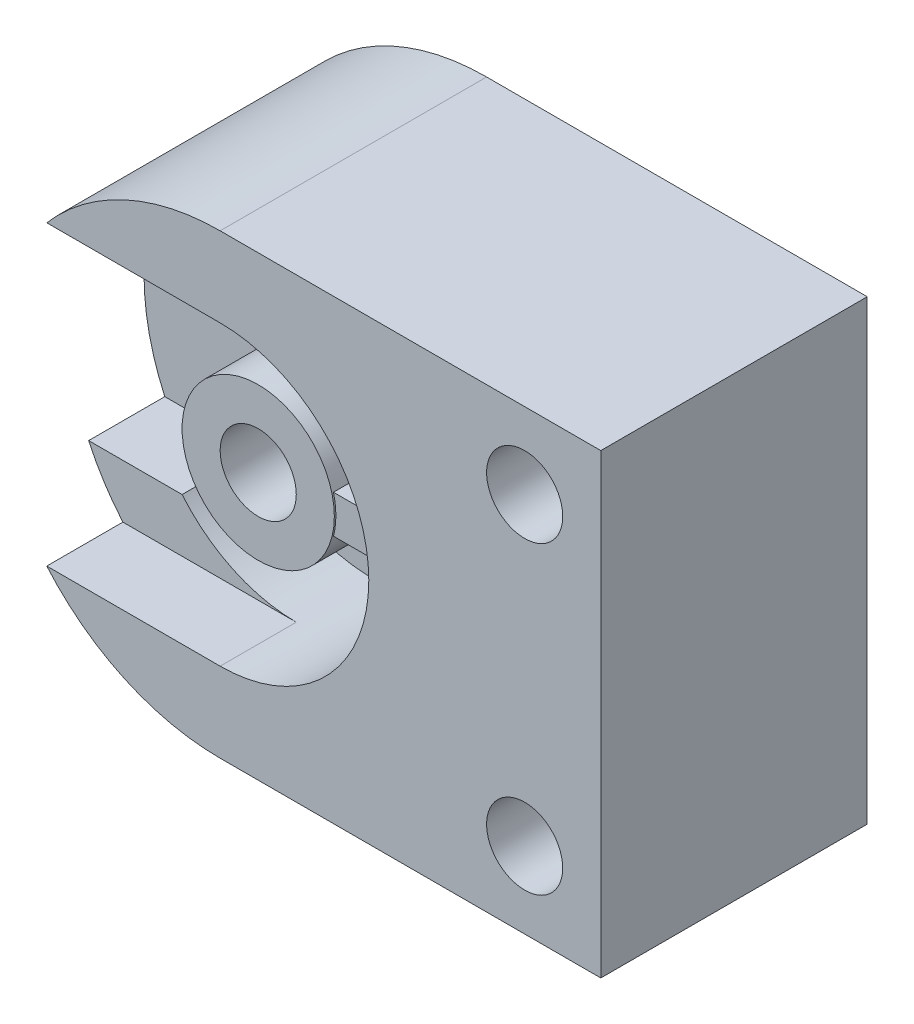
ISO-10303-21;
HEADER;
FILE_DESCRIPTION(('STEP AP214'),'2;1');
FILE_NAME('part.step','',(''),(''),'','','');
FILE_SCHEMA(('AUTOMOTIVE_DESIGN { 1 0 10303 214 1 1 1 1 }'));
ENDSEC;
DATA;
#1=APPLICATION_CONTEXT('core data for automotive mechanical design processes');
#2=APPLICATION_PROTOCOL_DEFINITION('international standard','automotive_design',2000,#1);
#3=PRODUCT_CONTEXT('',#1,'mechanical');
#4=PRODUCT('Part','Part','',(#3));
#5=PRODUCT_RELATED_PRODUCT_CATEGORY('part','',(#4));
#6=PRODUCT_DEFINITION_FORMATION('','',#4);
#7=PRODUCT_DEFINITION_CONTEXT('part definition',#1,'design');
#8=PRODUCT_DEFINITION('design','',#6,#7);
#9=PRODUCT_DEFINITION_SHAPE('','',#8);
#10=(LENGTH_UNIT() NAMED_UNIT(*) SI_UNIT(.MILLI.,.METRE.));
#11=(NAMED_UNIT(*) PLANE_ANGLE_UNIT() SI_UNIT($,.RADIAN.));
#12=(NAMED_UNIT(*) SI_UNIT($,.STERADIAN.) SOLID_ANGLE_UNIT());
#13=UNCERTAINTY_MEASURE_WITH_UNIT(LENGTH_MEASURE(1.E-05),#10,'distance_accuracy_value','');
#14=(GEOMETRIC_REPRESENTATION_CONTEXT(3) GLOBAL_UNCERTAINTY_ASSIGNED_CONTEXT((#13)) GLOBAL_UNIT_ASSIGNED_CONTEXT((#10,
#11,#12)) REPRESENTATION_CONTEXT('',''));
#15=CARTESIAN_POINT('',(0.,0.,0.));
#16=DIRECTION('',(0.,0.,1.));
#17=DIRECTION('',(1.,0.,0.));
#18=AXIS2_PLACEMENT_3D('',#15,#16,#17);
#19=CARTESIAN_POINT('',(60.,60.,0.));
#20=DIRECTION('',(0.,0.,1.));
#21=DIRECTION('',(1.,0.,0.));
#22=AXIS2_PLACEMENT_3D('',#19,#20,#21);
#23=CYLINDRICAL_SURFACE('',#22,60.);
#24=DIRECTION('',(0.,0.,-1.));
#25=VECTOR('',#24,1.);
#26=CARTESIAN_POINT('',(14.4478321042785,99.0512483795333,20.));
#27=LINE('',#26,#25);
#28=CARTESIAN_POINT('',(14.4478321042785,99.0512483795333,20.));
#29=VERTEX_POINT('',#28);
#30=CARTESIAN_POINT('',(14.4478321042785,99.0512483795333,0.));
#31=VERTEX_POINT('',#30);
#32=EDGE_CURVE('E290',#29,#31,#27,.T.);
#33=ORIENTED_EDGE('',*,*,#32,.F.);
#34=CARTESIAN_POINT('',(60.,60.,20.));
#35=DIRECTION('',(0.,0.,-1.));
#36=DIRECTION('',(-1.,0.,0.));
#37=AXIS2_PLACEMENT_3D('',#34,#35,#36);
#38=CIRCLE('',#37,60.);
#39=CARTESIAN_POINT('',(14.4478321042785,20.9487516204667,20.));
#40=VERTEX_POINT('',#39);
#41=EDGE_CURVE('E274',#40,#29,#38,.T.);
#42=ORIENTED_EDGE('',*,*,#41,.F.);
#43=DIRECTION('',(0.,0.,-1.));
#44=VECTOR('',#43,1.);
#45=CARTESIAN_POINT('',(14.4478321042785,20.9487516204667,20.));
#46=LINE('',#45,#44);
#47=CARTESIAN_POINT('',(14.4478321042785,20.9487516204667,0.));
#48=VERTEX_POINT('',#47);
#49=EDGE_CURVE('E292',#40,#48,#46,.T.);
#50=ORIENTED_EDGE('',*,*,#49,.T.);
#51=CARTESIAN_POINT('',(60.,60.,0.));
#52=DIRECTION('',(0.,0.,1.));
#53=DIRECTION('',(1.,0.,0.));
#54=AXIS2_PLACEMENT_3D('',#51,#52,#53);
#55=CIRCLE('',#54,60.);
#56=CARTESIAN_POINT('',(60.,0.,0.));
#57=VERTEX_POINT('',#56);
#58=EDGE_CURVE('E328',#48,#57,#55,.T.);
#59=ORIENTED_EDGE('',*,*,#58,.T.);
#60=DIRECTION('',(0.,0.,1.));
#61=VECTOR('',#60,1.);
#62=CARTESIAN_POINT('',(60.,0.,0.));
#63=LINE('',#62,#61);
#64=CARTESIAN_POINT('',(60.,0.,70.));
#65=VERTEX_POINT('',#64);
#66=EDGE_CURVE('E320',#57,#65,#63,.T.);
#67=ORIENTED_EDGE('',*,*,#66,.T.);
#68=CARTESIAN_POINT('',(60.,60.,70.));
#69=DIRECTION('',(0.,0.,1.));
#70=DIRECTION('',(1.,0.,0.));
#71=AXIS2_PLACEMENT_3D('',#68,#69,#70);
#72=CIRCLE('',#71,60.);
#73=CARTESIAN_POINT('',(14.4478321042785,20.9487516204667,70.));
#74=VERTEX_POINT('',#73);
#75=EDGE_CURVE('E323',#74,#65,#72,.T.);
#76=ORIENTED_EDGE('',*,*,#75,.F.);
#77=DIRECTION('',(0.,0.,1.));
#78=VECTOR('',#77,1.);
#79=CARTESIAN_POINT('',(14.4478321042785,20.9487516204667,50.));
#80=LINE('',#79,#78);
#81=CARTESIAN_POINT('',(14.4478321042785,20.9487516204667,50.));
#82=VERTEX_POINT('',#81);
#83=EDGE_CURVE('E261',#82,#74,#80,.T.);
#84=ORIENTED_EDGE('',*,*,#83,.F.);
#85=CARTESIAN_POINT('',(60.,60.,50.));
#86=DIRECTION('',(0.,0.,1.));
#87=DIRECTION('',(1.,0.,0.));
#88=AXIS2_PLACEMENT_3D('',#85,#86,#87);
#89=CIRCLE('',#88,60.);
#90=CARTESIAN_POINT('',(5.45643942682143,35.,50.));
#91=VERTEX_POINT('',#90);
#92=EDGE_CURVE('E242',#91,#82,#89,.T.);
#93=ORIENTED_EDGE('',*,*,#92,.F.);
#94=DIRECTION('',(0.,0.,1.));
#95=VECTOR('',#94,1.);
#96=CARTESIAN_POINT('',(5.45643942682143,35.,30.));
#97=LINE('',#96,#95);
#98=CARTESIAN_POINT('',(5.45643942682143,35.,30.));
#99=VERTEX_POINT('',#98);
#100=EDGE_CURVE('E233',#99,#91,#97,.T.);
#101=ORIENTED_EDGE('',*,*,#100,.F.);
#102=CARTESIAN_POINT('',(60.,60.,30.));
#103=DIRECTION('',(0.,0.,1.));
#104=DIRECTION('',(1.,0.,0.));
#105=AXIS2_PLACEMENT_3D('',#102,#103,#104);
#106=CIRCLE('',#105,60.);
#107=CARTESIAN_POINT('',(5.45643942682143,85.,30.));
#108=VERTEX_POINT('',#107);
#109=EDGE_CURVE('E216',#108,#99,#106,.T.);
#110=ORIENTED_EDGE('',*,*,#109,.F.);
#111=DIRECTION('',(0.,0.,1.));
#112=VECTOR('',#111,1.);
#113=CARTESIAN_POINT('',(5.45643942682143,85.,30.));
#114=LINE('',#113,#112);
#115=CARTESIAN_POINT('',(5.45643942682143,85.,50.));
#116=VERTEX_POINT('',#115);
#117=EDGE_CURVE('E235',#108,#116,#114,.T.);
#118=ORIENTED_EDGE('',*,*,#117,.T.);
#119=CARTESIAN_POINT('',(14.4478321042785,99.0512483795333,50.));
#120=VERTEX_POINT('',#119);
#121=EDGE_CURVE('E244',#120,#116,#89,.T.);
#122=ORIENTED_EDGE('',*,*,#121,.F.);
#123=DIRECTION('',(0.,0.,1.));
#124=VECTOR('',#123,1.);
#125=CARTESIAN_POINT('',(14.4478321042785,99.0512483795333,50.));
#126=LINE('',#125,#124);
#127=CARTESIAN_POINT('',(14.4478321042785,99.0512483795333,70.));
#128=VERTEX_POINT('',#127);
#129=EDGE_CURVE('E263',#120,#128,#126,.T.);
#130=ORIENTED_EDGE('',*,*,#129,.T.);
#131=CARTESIAN_POINT('',(60.,120.,70.));
#132=VERTEX_POINT('',#131);
#133=EDGE_CURVE('E329',#132,#128,#72,.T.);
#134=ORIENTED_EDGE('',*,*,#133,.F.);
#135=DIRECTION('',(0.,0.,1.));
#136=VECTOR('',#135,1.);
#137=CARTESIAN_POINT('',(60.,120.,0.));
#138=LINE('',#137,#136);
#139=CARTESIAN_POINT('',(60.,120.,0.));
#140=VERTEX_POINT('',#139);
#141=EDGE_CURVE('E327',#140,#132,#138,.T.);
#142=ORIENTED_EDGE('',*,*,#141,.F.);
#143=EDGE_CURVE('E324',#140,#31,#55,.T.);
#144=ORIENTED_EDGE('',*,*,#143,.T.);
#145=EDGE_LOOP('',(#33,#42,#50,#59,#67,#76,#84,#93,#101,#110,#118,#122,#130,#134,#142,#144));
#146=FACE_BOUND('',#145,.T.);
#147=ADVANCED_FACE('F33',(#146),#23,.T.);
#148=CARTESIAN_POINT('',(0.,0.,50.));
#149=DIRECTION('',(0.,0.,1.));
#150=DIRECTION('',(1.,0.,0.));
#151=AXIS2_PLACEMENT_3D('',#148,#149,#150);
#152=PLANE('',#151);
#153=DIRECTION('',(-1.,0.,0.));
#154=VECTOR('',#153,1.);
#155=CARTESIAN_POINT('',(0.,20.9487516204667,50.));
#156=LINE('',#155,#154);
#157=CARTESIAN_POINT('',(59.9999999999999,20.9487516204667,50.));
#158=VERTEX_POINT('',#157);
#159=EDGE_CURVE('E247',#158,#82,#156,.T.);
#160=ORIENTED_EDGE('',*,*,#159,.F.);
#161=CARTESIAN_POINT('',(60.,60.,50.));
#162=DIRECTION('',(0.,0.,1.));
#163=DIRECTION('',(1.,0.,0.));
#164=AXIS2_PLACEMENT_3D('',#161,#162,#163);
#165=CIRCLE('',#164,39.0512483795333);
#166=CARTESIAN_POINT('',(30.,35.,50.));
#167=VERTEX_POINT('',#166);
#168=EDGE_CURVE('E354',#158,#167,#165,.F.);
#169=ORIENTED_EDGE('',*,*,#168,.T.);
#170=DIRECTION('',(-1.,0.,0.));
#171=VECTOR('',#170,1.);
#172=CARTESIAN_POINT('',(0.,35.,50.));
#173=LINE('',#172,#171);
#174=EDGE_CURVE('E226',#167,#91,#173,.T.);
#175=ORIENTED_EDGE('',*,*,#174,.T.);
#176=ORIENTED_EDGE('',*,*,#92,.T.);
#177=EDGE_LOOP('',(#160,#169,#175,#176));
#178=FACE_BOUND('',#177,.T.);
#179=ADVANCED_FACE('F429',(#178),#152,.T.);
#180=DIRECTION('',(-1.,0.,0.));
#181=VECTOR('',#180,1.);
#182=CARTESIAN_POINT('',(0.,85.,50.));
#183=LINE('',#182,#181);
#184=CARTESIAN_POINT('',(30.,85.,50.));
#185=VERTEX_POINT('',#184);
#186=EDGE_CURVE('E224',#185,#116,#183,.T.);
#187=ORIENTED_EDGE('',*,*,#186,.F.);
#188=CARTESIAN_POINT('',(60.,60.,50.));
#189=DIRECTION('',(0.,0.,1.));
#190=DIRECTION('',(1.,0.,0.));
#191=AXIS2_PLACEMENT_3D('',#188,#189,#190);
#192=CIRCLE('',#191,39.0512483795333);
#193=CARTESIAN_POINT('',(60.0000000000004,99.0512483795333,50.));
#194=VERTEX_POINT('',#193);
#195=EDGE_CURVE('E56',#185,#194,#192,.F.);
#196=ORIENTED_EDGE('',*,*,#195,.T.);
#197=DIRECTION('',(-1.,0.,0.));
#198=VECTOR('',#197,1.);
#199=CARTESIAN_POINT('',(0.,99.0512483795333,50.));
#200=LINE('',#199,#198);
#201=EDGE_CURVE('E239',#194,#120,#200,.T.);
#202=ORIENTED_EDGE('',*,*,#201,.T.);
#203=ORIENTED_EDGE('',*,*,#121,.T.);
#204=EDGE_LOOP('',(#187,#196,#202,#203));
#205=FACE_BOUND('',#204,.T.);
#206=ADVANCED_FACE('F380',(#205),#152,.T.);
#207=CARTESIAN_POINT('',(0.,0.,70.));
#208=DIRECTION('',(0.,0.,-1.));
#209=DIRECTION('',(-1.,0.,0.));
#210=AXIS2_PLACEMENT_3D('',#207,#208,#209);
#211=PLANE('',#210);
#212=CARTESIAN_POINT('',(140.,20.,70.));
#213=DIRECTION('',(0.,0.,1.));
#214=DIRECTION('',(1.,0.,0.));
#215=AXIS2_PLACEMENT_3D('',#212,#213,#214);
#216=CIRCLE('',#215,10.);
#217=CARTESIAN_POINT('',(150.,20.,70.));
#218=VERTEX_POINT('',#217);
#219=EDGE_CURVE('E308',#218,#218,#216,.T.);
#220=ORIENTED_EDGE('',*,*,#219,.F.);
#221=EDGE_LOOP('',(#220));
#222=FACE_BOUND('',#221,.T.);
#223=CARTESIAN_POINT('',(140.,100.,70.));
#224=DIRECTION('',(0.,0.,1.));
#225=DIRECTION('',(1.,0.,0.));
#226=AXIS2_PLACEMENT_3D('',#223,#224,#225);
#227=CIRCLE('',#226,10.);
#228=CARTESIAN_POINT('',(150.,100.,70.));
#229=VERTEX_POINT('',#228);
#230=EDGE_CURVE('E289',#229,#229,#227,.T.);
#231=ORIENTED_EDGE('',*,*,#230,.F.);
#232=EDGE_LOOP('',(#231));
#233=FACE_BOUND('',#232,.T.);
#234=DIRECTION('',(-1.,0.,0.));
#235=VECTOR('',#234,1.);
#236=CARTESIAN_POINT('',(0.,20.9487516204667,70.));
#237=LINE('',#236,#235);
#238=CARTESIAN_POINT('',(59.9999999999999,20.9487516204667,70.));
#239=VERTEX_POINT('',#238);
#240=EDGE_CURVE('E243',#239,#74,#237,.T.);
#241=ORIENTED_EDGE('',*,*,#240,.T.);
#242=ORIENTED_EDGE('',*,*,#75,.T.);
#243=DIRECTION('',(1.,0.,0.));
#244=VECTOR('',#243,1.);
#245=CARTESIAN_POINT('',(0.,0.,70.));
#246=LINE('',#245,#244);
#247=CARTESIAN_POINT('',(160.,0.,70.));
#248=VERTEX_POINT('',#247);
#249=EDGE_CURVE('E335',#65,#248,#246,.T.);
#250=ORIENTED_EDGE('',*,*,#249,.T.);
#251=DIRECTION('',(0.,1.,0.));
#252=VECTOR('',#251,1.);
#253=CARTESIAN_POINT('',(160.,0.,70.));
#254=LINE('',#253,#252);
#255=CARTESIAN_POINT('',(160.,120.,70.));
#256=VERTEX_POINT('',#255);
#257=EDGE_CURVE('E337',#248,#256,#254,.T.);
#258=ORIENTED_EDGE('',*,*,#257,.T.);
#259=DIRECTION('',(-1.,0.,0.));
#260=VECTOR('',#259,1.);
#261=CARTESIAN_POINT('',(0.,120.,70.));
#262=LINE('',#261,#260);
#263=EDGE_CURVE('E340',#256,#132,#262,.T.);
#264=ORIENTED_EDGE('',*,*,#263,.T.);
#265=ORIENTED_EDGE('',*,*,#133,.T.);
#266=DIRECTION('',(-1.,0.,0.));
#267=VECTOR('',#266,1.);
#268=CARTESIAN_POINT('',(0.,99.0512483795333,70.));
#269=LINE('',#268,#267);
#270=CARTESIAN_POINT('',(60.0000000000004,99.0512483795333,70.));
#271=VERTEX_POINT('',#270);
#272=EDGE_CURVE('E253',#271,#128,#269,.T.);
#273=ORIENTED_EDGE('',*,*,#272,.F.);
#274=CARTESIAN_POINT('',(60.,60.,70.));
#275=DIRECTION('',(0.,0.,1.));
#276=DIRECTION('',(1.,0.,0.));
#277=AXIS2_PLACEMENT_3D('',#274,#275,#276);
#278=CIRCLE('',#277,39.0512483795333);
#279=EDGE_CURVE('E232',#271,#239,#278,.F.);
#280=ORIENTED_EDGE('',*,*,#279,.T.);
#281=EDGE_LOOP('',(#241,#242,#250,#258,#264,#265,#273,#280));
#282=FACE_BOUND('',#281,.T.);
#283=ADVANCED_FACE('F386',(#222,#233,#282),#211,.F.);
#284=CARTESIAN_POINT('',(60.,60.,70.));
#285=DIRECTION('',(0.,0.,-1.));
#286=DIRECTION('',(-1.,0.,0.));
#287=AXIS2_PLACEMENT_3D('',#284,#285,#286);
#288=CYLINDRICAL_SURFACE('',#287,9.99999999999999);
#289=CARTESIAN_POINT('',(60.,60.,20.));
#290=DIRECTION('',(0.,0.,-1.));
#291=DIRECTION('',(-1.,0.,0.));
#292=AXIS2_PLACEMENT_3D('',#289,#290,#291);
#293=CIRCLE('',#292,9.99999999999999);
#294=CARTESIAN_POINT('',(50.,60.,20.));
#295=VERTEX_POINT('',#294);
#296=EDGE_CURVE('E260',#295,#295,#293,.T.);
#297=ORIENTED_EDGE('',*,*,#296,.T.);
#298=EDGE_LOOP('',(#297));
#299=FACE_BOUND('',#298,.T.);
#300=CARTESIAN_POINT('',(60.,60.,60.));
#301=DIRECTION('',(0.,0.,1.));
#302=DIRECTION('',(1.,0.,0.));
#303=AXIS2_PLACEMENT_3D('',#300,#301,#302);
#304=CIRCLE('',#303,9.99999999999999);
#305=CARTESIAN_POINT('',(70.,60.,60.));
#306=VERTEX_POINT('',#305);
#307=EDGE_CURVE('E203',#306,#306,#304,.T.);
#308=ORIENTED_EDGE('',*,*,#307,.T.);
#309=EDGE_LOOP('',(#308));
#310=FACE_BOUND('',#309,.T.);
#311=ADVANCED_FACE('F442',(#299,#310),#288,.F.);
#312=CARTESIAN_POINT('',(0.,0.,0.));
#313=DIRECTION('',(0.,0.,-1.));
#314=DIRECTION('',(-1.,0.,0.));
#315=AXIS2_PLACEMENT_3D('',#312,#313,#314);
#316=PLANE('',#315);
#317=DIRECTION('',(-1.,0.,0.));
#318=VECTOR('',#317,1.);
#319=CARTESIAN_POINT('',(0.,120.,0.));
#320=LINE('',#319,#318);
#321=CARTESIAN_POINT('',(160.,120.,0.));
#322=VERTEX_POINT('',#321);
#323=EDGE_CURVE('E338',#322,#140,#320,.T.);
#324=ORIENTED_EDGE('',*,*,#323,.F.);
#325=DIRECTION('',(0.,1.,0.));
#326=VECTOR('',#325,1.);
#327=CARTESIAN_POINT('',(160.,0.,0.));
#328=LINE('',#327,#326);
#329=CARTESIAN_POINT('',(160.,0.,0.));
#330=VERTEX_POINT('',#329);
#331=EDGE_CURVE('E345',#330,#322,#328,.T.);
#332=ORIENTED_EDGE('',*,*,#331,.F.);
#333=DIRECTION('',(1.,0.,0.));
#334=VECTOR('',#333,1.);
#335=CARTESIAN_POINT('',(0.,0.,0.));
#336=LINE('',#335,#334);
#337=EDGE_CURVE('E334',#57,#330,#336,.T.);
#338=ORIENTED_EDGE('',*,*,#337,.F.);
#339=ORIENTED_EDGE('',*,*,#58,.F.);
#340=DIRECTION('',(-1.,0.,0.));
#341=VECTOR('',#340,1.);
#342=CARTESIAN_POINT('',(0.,20.9487516204667,0.));
#343=LINE('',#342,#341);
#344=CARTESIAN_POINT('',(60.0000000000001,20.9487516204667,0.));
#345=VERTEX_POINT('',#344);
#346=EDGE_CURVE('E282',#345,#48,#343,.T.);
#347=ORIENTED_EDGE('',*,*,#346,.F.);
#348=CARTESIAN_POINT('',(60.,60.,0.));
#349=DIRECTION('',(0.,0.,-1.));
#350=DIRECTION('',(-1.,0.,0.));
#351=AXIS2_PLACEMENT_3D('',#348,#349,#350);
#352=CIRCLE('',#351,39.0512483795333);
#353=CARTESIAN_POINT('',(59.9999999999996,99.0512483795333,0.));
#354=VERTEX_POINT('',#353);
#355=EDGE_CURVE('E280',#345,#354,#352,.F.);
#356=ORIENTED_EDGE('',*,*,#355,.T.);
#357=DIRECTION('',(-1.,0.,0.));
#358=VECTOR('',#357,1.);
#359=CARTESIAN_POINT('',(0.,99.0512483795333,0.));
#360=LINE('',#359,#358);
#361=EDGE_CURVE('E271',#354,#31,#360,.T.);
#362=ORIENTED_EDGE('',*,*,#361,.T.);
#363=ORIENTED_EDGE('',*,*,#143,.F.);
#364=EDGE_LOOP('',(#324,#332,#338,#339,#347,#356,#362,#363));
#365=FACE_BOUND('',#364,.T.);
#366=ADVANCED_FACE('F395',(#365),#316,.T.);
#367=CARTESIAN_POINT('',(0.,0.,70.));
#368=DIRECTION('',(0.,1.,0.));
#369=DIRECTION('',(0.,0.,1.));
#370=AXIS2_PLACEMENT_3D('',#367,#368,#369);
#371=PLANE('',#370);
#372=ORIENTED_EDGE('',*,*,#66,.F.);
#373=ORIENTED_EDGE('',*,*,#337,.T.);
#374=DIRECTION('',(0.,0.,-1.));
#375=VECTOR('',#374,1.);
#376=CARTESIAN_POINT('',(160.,0.,70.));
#377=LINE('',#376,#375);
#378=EDGE_CURVE('E351',#248,#330,#377,.T.);
#379=ORIENTED_EDGE('',*,*,#378,.F.);
#380=ORIENTED_EDGE('',*,*,#249,.F.);
#381=EDGE_LOOP('',(#372,#373,#379,#380));
#382=FACE_BOUND('',#381,.T.);
#383=ADVANCED_FACE('F35',(#382),#371,.F.);
#384=CARTESIAN_POINT('',(160.,0.,70.));
#385=DIRECTION('',(-1.,0.,0.));
#386=DIRECTION('',(0.,0.,1.));
#387=AXIS2_PLACEMENT_3D('',#384,#385,#386);
#388=PLANE('',#387);
#389=ORIENTED_EDGE('',*,*,#331,.T.);
#390=DIRECTION('',(0.,0.,-1.));
#391=VECTOR('',#390,1.);
#392=CARTESIAN_POINT('',(160.,120.,70.));
#393=LINE('',#392,#391);
#394=EDGE_CURVE('E343',#256,#322,#393,.T.);
#395=ORIENTED_EDGE('',*,*,#394,.F.);
#396=ORIENTED_EDGE('',*,*,#257,.F.);
#397=ORIENTED_EDGE('',*,*,#378,.T.);
#398=EDGE_LOOP('',(#389,#395,#396,#397));
#399=FACE_BOUND('',#398,.T.);
#400=ADVANCED_FACE('F418',(#399),#388,.F.);
#401=CARTESIAN_POINT('',(0.,120.,70.));
#402=DIRECTION('',(0.,-1.,0.));
#403=DIRECTION('',(0.,0.,-1.));
#404=AXIS2_PLACEMENT_3D('',#401,#402,#403);
#405=PLANE('',#404);
#406=ORIENTED_EDGE('',*,*,#323,.T.);
#407=ORIENTED_EDGE('',*,*,#141,.T.);
#408=ORIENTED_EDGE('',*,*,#263,.F.);
#409=ORIENTED_EDGE('',*,*,#394,.T.);
#410=EDGE_LOOP('',(#406,#407,#408,#409));
#411=FACE_BOUND('',#410,.T.);
#412=ADVANCED_FACE('F391',(#411),#405,.F.);
#413=CARTESIAN_POINT('',(140.,20.,40.));
#414=DIRECTION('',(0.,0.,1.));
#415=DIRECTION('',(1.,0.,0.));
#416=AXIS2_PLACEMENT_3D('',#413,#414,#415);
#417=CONICAL_SURFACE('',#416,8.74999999999998,1.02974425867665);
#418=CARTESIAN_POINT('',(140.,20.,34.7424695835088));
#419=VERTEX_POINT('',#418);
#420=VERTEX_LOOP('',#419);
#421=FACE_BOUND('',#420,.T.);
#422=CARTESIAN_POINT('',(140.,20.,40.));
#423=DIRECTION('',(0.,0.,1.));
#424=DIRECTION('',(1.,0.,0.));
#425=AXIS2_PLACEMENT_3D('',#422,#423,#424);
#426=CIRCLE('',#425,8.74999999999998);
#427=CARTESIAN_POINT('',(148.75,20.,40.));
#428=VERTEX_POINT('',#427);
#429=EDGE_CURVE('E317',#428,#428,#426,.T.);
#430=ORIENTED_EDGE('',*,*,#429,.T.);
#431=EDGE_LOOP('',(#430));
#432=FACE_BOUND('',#431,.T.);
#433=ADVANCED_FACE('F425',(#421,#432),#417,.F.);
#434=CARTESIAN_POINT('',(140.,20.,70.));
#435=DIRECTION('',(0.,0.,1.));
#436=DIRECTION('',(1.,0.,0.));
#437=AXIS2_PLACEMENT_3D('',#434,#435,#436);
#438=CYLINDRICAL_SURFACE('',#437,8.74999999999999);
#439=ORIENTED_EDGE('',*,*,#429,.F.);
#440=EDGE_LOOP('',(#439));
#441=FACE_BOUND('',#440,.T.);
#442=CARTESIAN_POINT('',(140.,20.,45.));
#443=DIRECTION('',(0.,0.,1.));
#444=DIRECTION('',(1.,0.,0.));
#445=AXIS2_PLACEMENT_3D('',#442,#443,#444);
#446=CIRCLE('',#445,8.75000000000001);
#447=CARTESIAN_POINT('',(148.75,20.,45.));
#448=VERTEX_POINT('',#447);
#449=EDGE_CURVE('E314',#448,#448,#446,.T.);
#450=ORIENTED_EDGE('',*,*,#449,.T.);
#451=EDGE_LOOP('',(#450));
#452=FACE_BOUND('',#451,.T.);
#453=ADVANCED_FACE('F478',(#441,#452),#438,.F.);
#454=CARTESIAN_POINT('',(148.75,20.,45.));
#455=DIRECTION('',(0.,0.,-1.));
#456=DIRECTION('',(-1.,0.,0.));
#457=AXIS2_PLACEMENT_3D('',#454,#455,#456);
#458=PLANE('',#457);
#459=ORIENTED_EDGE('',*,*,#449,.F.);
#460=EDGE_LOOP('',(#459));
#461=FACE_BOUND('',#460,.T.);
#462=CARTESIAN_POINT('',(140.,20.,45.));
#463=DIRECTION('',(0.,0.,1.));
#464=DIRECTION('',(1.,0.,0.));
#465=AXIS2_PLACEMENT_3D('',#462,#463,#464);
#466=CIRCLE('',#465,10.);
#467=CARTESIAN_POINT('',(150.,20.,45.));
#468=VERTEX_POINT('',#467);
#469=EDGE_CURVE('E311',#468,#468,#466,.T.);
#470=ORIENTED_EDGE('',*,*,#469,.T.);
#471=EDGE_LOOP('',(#470));
#472=FACE_BOUND('',#471,.T.);
#473=ADVANCED_FACE('F475',(#461,#472),#458,.F.);
#474=CARTESIAN_POINT('',(140.,20.,70.));
#475=DIRECTION('',(0.,0.,1.));
#476=DIRECTION('',(1.,0.,0.));
#477=AXIS2_PLACEMENT_3D('',#474,#475,#476);
#478=CYLINDRICAL_SURFACE('',#477,10.);
#479=ORIENTED_EDGE('',*,*,#469,.F.);
#480=EDGE_LOOP('',(#479));
#481=FACE_BOUND('',#480,.T.);
#482=ORIENTED_EDGE('',*,*,#219,.T.);
#483=EDGE_LOOP('',(#482));
#484=FACE_BOUND('',#483,.T.);
#485=ADVANCED_FACE('F471',(#481,#484),#478,.F.);
#486=CARTESIAN_POINT('',(140.,100.,40.));
#487=DIRECTION('',(0.,0.,1.));
#488=DIRECTION('',(1.,0.,0.));
#489=AXIS2_PLACEMENT_3D('',#486,#487,#488);
#490=CONICAL_SURFACE('',#489,8.74999999999998,1.02974425867665);
#491=CARTESIAN_POINT('',(140.,100.,34.7424695835088));
#492=VERTEX_POINT('',#491);
#493=VERTEX_LOOP('',#492);
#494=FACE_BOUND('',#493,.T.);
#495=CARTESIAN_POINT('',(140.,100.,40.));
#496=DIRECTION('',(0.,0.,1.));
#497=DIRECTION('',(1.,0.,0.));
#498=AXIS2_PLACEMENT_3D('',#495,#496,#497);
#499=CIRCLE('',#498,8.74999999999998);
#500=CARTESIAN_POINT('',(148.75,100.,40.));
#501=VERTEX_POINT('',#500);
#502=EDGE_CURVE('E305',#501,#501,#499,.T.);
#503=ORIENTED_EDGE('',*,*,#502,.T.);
#504=EDGE_LOOP('',(#503));
#505=FACE_BOUND('',#504,.T.);
#506=ADVANCED_FACE('F467',(#494,#505),#490,.F.);
#507=CARTESIAN_POINT('',(140.,100.,70.));
#508=DIRECTION('',(0.,0.,1.));
#509=DIRECTION('',(1.,0.,0.));
#510=AXIS2_PLACEMENT_3D('',#507,#508,#509);
#511=CYLINDRICAL_SURFACE('',#510,8.74999999999999);
#512=ORIENTED_EDGE('',*,*,#502,.F.);
#513=EDGE_LOOP('',(#512));
#514=FACE_BOUND('',#513,.T.);
#515=CARTESIAN_POINT('',(140.,100.,45.));
#516=DIRECTION('',(0.,0.,1.));
#517=DIRECTION('',(1.,0.,0.));
#518=AXIS2_PLACEMENT_3D('',#515,#516,#517);
#519=CIRCLE('',#518,8.75000000000001);
#520=CARTESIAN_POINT('',(148.75,100.,45.));
#521=VERTEX_POINT('',#520);
#522=EDGE_CURVE('E302',#521,#521,#519,.T.);
#523=ORIENTED_EDGE('',*,*,#522,.T.);
#524=EDGE_LOOP('',(#523));
#525=FACE_BOUND('',#524,.T.);
#526=ADVANCED_FACE('F463',(#514,#525),#511,.F.);
#527=CARTESIAN_POINT('',(148.75,100.,45.));
#528=DIRECTION('',(0.,0.,-1.));
#529=DIRECTION('',(-1.,0.,0.));
#530=AXIS2_PLACEMENT_3D('',#527,#528,#529);
#531=PLANE('',#530);
#532=ORIENTED_EDGE('',*,*,#522,.F.);
#533=EDGE_LOOP('',(#532));
#534=FACE_BOUND('',#533,.T.);
#535=CARTESIAN_POINT('',(140.,100.,45.));
#536=DIRECTION('',(0.,0.,1.));
#537=DIRECTION('',(1.,0.,0.));
#538=AXIS2_PLACEMENT_3D('',#535,#536,#537);
#539=CIRCLE('',#538,10.);
#540=CARTESIAN_POINT('',(150.,100.,45.));
#541=VERTEX_POINT('',#540);
#542=EDGE_CURVE('E299',#541,#541,#539,.T.);
#543=ORIENTED_EDGE('',*,*,#542,.T.);
#544=EDGE_LOOP('',(#543));
#545=FACE_BOUND('',#544,.T.);
#546=ADVANCED_FACE('F459',(#534,#545),#531,.F.);
#547=CARTESIAN_POINT('',(140.,100.,70.));
#548=DIRECTION('',(0.,0.,1.));
#549=DIRECTION('',(1.,0.,0.));
#550=AXIS2_PLACEMENT_3D('',#547,#548,#549);
#551=CYLINDRICAL_SURFACE('',#550,10.);
#552=ORIENTED_EDGE('',*,*,#542,.F.);
#553=EDGE_LOOP('',(#552));
#554=FACE_BOUND('',#553,.T.);
#555=ORIENTED_EDGE('',*,*,#230,.T.);
#556=EDGE_LOOP('',(#555));
#557=FACE_BOUND('',#556,.T.);
#558=ADVANCED_FACE('F456',(#554,#557),#551,.F.);
#559=CARTESIAN_POINT('',(60.,60.,20.));
#560=DIRECTION('',(0.,0.,-1.));
#561=DIRECTION('',(-1.,0.,0.));
#562=AXIS2_PLACEMENT_3D('',#559,#560,#561);
#563=CYLINDRICAL_SURFACE('',#562,39.0512483795333);
#564=DIRECTION('',(0.,0.,-1.));
#565=VECTOR('',#564,1.);
#566=CARTESIAN_POINT('',(59.9999999999996,99.0512483795333,20.));
#567=LINE('',#566,#565);
#568=CARTESIAN_POINT('',(59.9999999999996,99.0512483795333,20.));
#569=VERTEX_POINT('',#568);
#570=EDGE_CURVE('E286',#569,#354,#567,.T.);
#571=ORIENTED_EDGE('',*,*,#570,.T.);
#572=ORIENTED_EDGE('',*,*,#355,.F.);
#573=DIRECTION('',(0.,0.,-1.));
#574=VECTOR('',#573,1.);
#575=CARTESIAN_POINT('',(60.0000000000001,20.9487516204667,20.));
#576=LINE('',#575,#574);
#577=CARTESIAN_POINT('',(60.0000000000001,20.9487516204667,20.));
#578=VERTEX_POINT('',#577);
#579=EDGE_CURVE('E279',#578,#345,#576,.T.);
#580=ORIENTED_EDGE('',*,*,#579,.F.);
#581=CARTESIAN_POINT('',(60.,60.,20.));
#582=DIRECTION('',(0.,0.,-1.));
#583=DIRECTION('',(-1.,0.,0.));
#584=AXIS2_PLACEMENT_3D('',#581,#582,#583);
#585=CIRCLE('',#584,39.0512483795333);
#586=EDGE_CURVE('E268',#578,#569,#585,.F.);
#587=ORIENTED_EDGE('',*,*,#586,.T.);
#588=EDGE_LOOP('',(#571,#572,#580,#587));
#589=FACE_BOUND('',#588,.T.);
#590=ADVANCED_FACE('F403',(#589),#563,.F.);
#591=CARTESIAN_POINT('',(0.,99.0512483795333,20.));
#592=DIRECTION('',(0.,-1.,0.));
#593=DIRECTION('',(0.,0.,-1.));
#594=AXIS2_PLACEMENT_3D('',#591,#592,#593);
#595=PLANE('',#594);
#596=ORIENTED_EDGE('',*,*,#361,.F.);
#597=ORIENTED_EDGE('',*,*,#570,.F.);
#598=DIRECTION('',(-1.,0.,0.));
#599=VECTOR('',#598,1.);
#600=CARTESIAN_POINT('',(0.,99.0512483795333,20.));
#601=LINE('',#600,#599);
#602=EDGE_CURVE('E276',#569,#29,#601,.T.);
#603=ORIENTED_EDGE('',*,*,#602,.T.);
#604=ORIENTED_EDGE('',*,*,#32,.T.);
#605=EDGE_LOOP('',(#596,#597,#603,#604));
#606=FACE_BOUND('',#605,.T.);
#607=ADVANCED_FACE('F401',(#606),#595,.T.);
#608=CARTESIAN_POINT('',(0.,20.9487516204667,20.));
#609=DIRECTION('',(0.,-1.,0.));
#610=DIRECTION('',(0.,0.,-1.));
#611=AXIS2_PLACEMENT_3D('',#608,#609,#610);
#612=PLANE('',#611);
#613=ORIENTED_EDGE('',*,*,#346,.T.);
#614=ORIENTED_EDGE('',*,*,#49,.F.);
#615=DIRECTION('',(-1.,0.,0.));
#616=VECTOR('',#615,1.);
#617=CARTESIAN_POINT('',(0.,20.9487516204667,20.));
#618=LINE('',#617,#616);
#619=EDGE_CURVE('E270',#578,#40,#618,.T.);
#620=ORIENTED_EDGE('',*,*,#619,.F.);
#621=ORIENTED_EDGE('',*,*,#579,.T.);
#622=EDGE_LOOP('',(#613,#614,#620,#621));
#623=FACE_BOUND('',#622,.T.);
#624=ADVANCED_FACE('F567',(#623),#612,.F.);
#625=CARTESIAN_POINT('',(0.,0.,20.));
#626=DIRECTION('',(0.,0.,-1.));
#627=DIRECTION('',(-1.,0.,0.));
#628=AXIS2_PLACEMENT_3D('',#625,#626,#627);
#629=PLANE('',#628);
#630=ORIENTED_EDGE('',*,*,#296,.F.);
#631=EDGE_LOOP('',(#630));
#632=FACE_BOUND('',#631,.T.);
#633=ORIENTED_EDGE('',*,*,#41,.T.);
#634=ORIENTED_EDGE('',*,*,#602,.F.);
#635=ORIENTED_EDGE('',*,*,#586,.F.);
#636=ORIENTED_EDGE('',*,*,#619,.T.);
#637=EDGE_LOOP('',(#633,#634,#635,#636));
#638=FACE_BOUND('',#637,.T.);
#639=ADVANCED_FACE('F408',(#632,#638),#629,.T.);
#640=CARTESIAN_POINT('',(60.,60.,50.));
#641=DIRECTION('',(0.,0.,1.));
#642=DIRECTION('',(1.,0.,0.));
#643=AXIS2_PLACEMENT_3D('',#640,#641,#642);
#644=CYLINDRICAL_SURFACE('',#643,39.0512483795333);
#645=DIRECTION('',(0.,0.,1.));
#646=VECTOR('',#645,1.);
#647=CARTESIAN_POINT('',(98.7298334620741,65.,50.));
#648=LINE('',#647,#646);
#649=CARTESIAN_POINT('',(98.7298334620741,65.,59.5983877847743));
#650=VERTEX_POINT('',#649);
#651=CARTESIAN_POINT('',(98.7298334620742,65.,30.));
#652=VERTEX_POINT('',#651);
#653=EDGE_CURVE('E199',#650,#652,#648,.F.);
#654=ORIENTED_EDGE('',*,*,#653,.F.);
#655=CARTESIAN_POINT('',(60.,60.,59.5983877847743));
#656=DIRECTION('',(0.,0.,1.));
#657=DIRECTION('',(1.,0.,0.));
#658=AXIS2_PLACEMENT_3D('',#655,#656,#657);
#659=CIRCLE('',#658,39.0512483795333);
#660=CARTESIAN_POINT('',(98.7298334620741,55.,59.5983877847743));
#661=VERTEX_POINT('',#660);
#662=EDGE_CURVE('E201',#661,#650,#659,.T.);
#663=ORIENTED_EDGE('',*,*,#662,.F.);
#664=DIRECTION('',(0.,0.,1.));
#665=VECTOR('',#664,1.);
#666=CARTESIAN_POINT('',(98.7298334620741,55.,50.));
#667=LINE('',#666,#665);
#668=CARTESIAN_POINT('',(98.7298334620742,55.,30.));
#669=VERTEX_POINT('',#668);
#670=EDGE_CURVE('E189',#661,#669,#667,.F.);
#671=ORIENTED_EDGE('',*,*,#670,.T.);
#672=CARTESIAN_POINT('',(60.,60.,30.));
#673=DIRECTION('',(0.,0.,1.));
#674=DIRECTION('',(1.,0.,0.));
#675=AXIS2_PLACEMENT_3D('',#672,#673,#674);
#676=CIRCLE('',#675,39.0512483795333);
#677=CARTESIAN_POINT('',(30.,35.,30.));
#678=VERTEX_POINT('',#677);
#679=EDGE_CURVE('E213',#669,#678,#676,.F.);
#680=ORIENTED_EDGE('',*,*,#679,.T.);
#681=DIRECTION('',(0.,0.,1.));
#682=VECTOR('',#681,1.);
#683=CARTESIAN_POINT('',(30.,35.,30.));
#684=LINE('',#683,#682);
#685=EDGE_CURVE('E229',#678,#167,#684,.T.);
#686=ORIENTED_EDGE('',*,*,#685,.T.);
#687=ORIENTED_EDGE('',*,*,#168,.F.);
#688=DIRECTION('',(0.,0.,1.));
#689=VECTOR('',#688,1.);
#690=CARTESIAN_POINT('',(59.9999999999999,20.9487516204667,50.));
#691=LINE('',#690,#689);
#692=EDGE_CURVE('E257',#158,#239,#691,.T.);
#693=ORIENTED_EDGE('',*,*,#692,.T.);
#694=ORIENTED_EDGE('',*,*,#279,.F.);
#695=DIRECTION('',(0.,0.,1.));
#696=VECTOR('',#695,1.);
#697=CARTESIAN_POINT('',(60.0000000000004,99.0512483795333,50.));
#698=LINE('',#697,#696);
#699=EDGE_CURVE('E250',#194,#271,#698,.T.);
#700=ORIENTED_EDGE('',*,*,#699,.F.);
#701=ORIENTED_EDGE('',*,*,#195,.F.);
#702=DIRECTION('',(0.,0.,1.));
#703=VECTOR('',#702,1.);
#704=CARTESIAN_POINT('',(30.,85.,30.));
#705=LINE('',#704,#703);
#706=CARTESIAN_POINT('',(30.,85.,30.));
#707=VERTEX_POINT('',#706);
#708=EDGE_CURVE('E222',#707,#185,#705,.T.);
#709=ORIENTED_EDGE('',*,*,#708,.F.);
#710=EDGE_CURVE('E209',#707,#652,#676,.F.);
#711=ORIENTED_EDGE('',*,*,#710,.T.);
#712=EDGE_LOOP('',(#654,#663,#671,#680,#686,#687,#693,#694,#700,#701,#709,#711));
#713=FACE_BOUND('',#712,.T.);
#714=ADVANCED_FACE('F369',(#713),#644,.F.);
#715=CARTESIAN_POINT('',(0.,20.9487516204667,50.));
#716=DIRECTION('',(0.,1.,0.));
#717=DIRECTION('',(0.,0.,1.));
#718=AXIS2_PLACEMENT_3D('',#715,#716,#717);
#719=PLANE('',#718);
#720=ORIENTED_EDGE('',*,*,#240,.F.);
#721=ORIENTED_EDGE('',*,*,#692,.F.);
#722=ORIENTED_EDGE('',*,*,#159,.T.);
#723=ORIENTED_EDGE('',*,*,#83,.T.);
#724=EDGE_LOOP('',(#720,#721,#722,#723));
#725=FACE_BOUND('',#724,.T.);
#726=ADVANCED_FACE('F615',(#725),#719,.T.);
#727=CARTESIAN_POINT('',(0.,99.0512483795333,50.));
#728=DIRECTION('',(0.,1.,0.));
#729=DIRECTION('',(0.,0.,1.));
#730=AXIS2_PLACEMENT_3D('',#727,#728,#729);
#731=PLANE('',#730);
#732=ORIENTED_EDGE('',*,*,#272,.T.);
#733=ORIENTED_EDGE('',*,*,#129,.F.);
#734=ORIENTED_EDGE('',*,*,#201,.F.);
#735=ORIENTED_EDGE('',*,*,#699,.T.);
#736=EDGE_LOOP('',(#732,#733,#734,#735));
#737=FACE_BOUND('',#736,.T.);
#738=ADVANCED_FACE('F383',(#737),#731,.F.);
#739=CARTESIAN_POINT('',(0.,35.,30.));
#740=DIRECTION('',(0.,1.,0.));
#741=DIRECTION('',(0.,0.,1.));
#742=AXIS2_PLACEMENT_3D('',#739,#740,#741);
#743=PLANE('',#742);
#744=ORIENTED_EDGE('',*,*,#174,.F.);
#745=ORIENTED_EDGE('',*,*,#685,.F.);
#746=DIRECTION('',(-1.,0.,0.));
#747=VECTOR('',#746,1.);
#748=CARTESIAN_POINT('',(0.,35.,30.));
#749=LINE('',#748,#747);
#750=EDGE_CURVE('E218',#678,#99,#749,.T.);
#751=ORIENTED_EDGE('',*,*,#750,.T.);
#752=ORIENTED_EDGE('',*,*,#100,.T.);
#753=EDGE_LOOP('',(#744,#745,#751,#752));
#754=FACE_BOUND('',#753,.T.);
#755=ADVANCED_FACE('F635',(#754),#743,.T.);
#756=CARTESIAN_POINT('',(60.,60.,30.));
#757=DIRECTION('',(0.,0.,1.));
#758=DIRECTION('',(1.,0.,0.));
#759=AXIS2_PLACEMENT_3D('',#756,#757,#758);
#760=CYLINDRICAL_SURFACE('',#759,20.);
#761=CARTESIAN_POINT('',(60.,60.,30.));
#762=DIRECTION('',(0.,0.,1.));
#763=DIRECTION('',(1.,0.,0.));
#764=AXIS2_PLACEMENT_3D('',#761,#762,#763);
#765=CIRCLE('',#764,20.);
#766=CARTESIAN_POINT('',(79.3649167310371,65.,30.));
#767=VERTEX_POINT('',#766);
#768=CARTESIAN_POINT('',(79.3649167310371,55.,30.));
#769=VERTEX_POINT('',#768);
#770=EDGE_CURVE('E48',#767,#769,#765,.T.);
#771=ORIENTED_EDGE('',*,*,#770,.T.);
#772=DIRECTION('',(0.,0.,1.));
#773=VECTOR('',#772,1.);
#774=CARTESIAN_POINT('',(79.3649167310371,55.,30.));
#775=LINE('',#774,#773);
#776=CARTESIAN_POINT('',(79.3649167310371,55.,59.5983877847743));
#777=VERTEX_POINT('',#776);
#778=EDGE_CURVE('E186',#769,#777,#775,.T.);
#779=ORIENTED_EDGE('',*,*,#778,.T.);
#780=CARTESIAN_POINT('',(60.,60.,59.5983877847743));
#781=DIRECTION('',(0.,0.,1.));
#782=DIRECTION('',(1.,0.,0.));
#783=AXIS2_PLACEMENT_3D('',#780,#781,#782);
#784=CIRCLE('',#783,20.);
#785=CARTESIAN_POINT('',(79.3649167310371,65.,59.5983877847743));
#786=VERTEX_POINT('',#785);
#787=EDGE_CURVE('E11',#786,#777,#784,.F.);
#788=ORIENTED_EDGE('',*,*,#787,.F.);
#789=DIRECTION('',(0.,0.,1.));
#790=VECTOR('',#789,1.);
#791=CARTESIAN_POINT('',(79.3649167310371,65.,30.));
#792=LINE('',#791,#790);
#793=EDGE_CURVE('E194',#767,#786,#792,.T.);
#794=ORIENTED_EDGE('',*,*,#793,.F.);
#795=EDGE_LOOP('',(#771,#779,#788,#794));
#796=FACE_BOUND('',#795,.T.);
#797=CARTESIAN_POINT('',(60.,60.,60.));
#798=DIRECTION('',(0.,0.,1.));
#799=DIRECTION('',(1.,0.,0.));
#800=AXIS2_PLACEMENT_3D('',#797,#798,#799);
#801=CIRCLE('',#800,20.);
#802=CARTESIAN_POINT('',(80.,60.,60.));
#803=VERTEX_POINT('',#802);
#804=EDGE_CURVE('E206',#803,#803,#801,.T.);
#805=ORIENTED_EDGE('',*,*,#804,.F.);
#806=EDGE_LOOP('',(#805));
#807=FACE_BOUND('',#806,.T.);
#808=ADVANCED_FACE('F191',(#796,#807),#760,.T.);
#809=CARTESIAN_POINT('',(0.,85.,30.));
#810=DIRECTION('',(0.,1.,0.));
#811=DIRECTION('',(0.,0.,1.));
#812=AXIS2_PLACEMENT_3D('',#809,#810,#811);
#813=PLANE('',#812);
#814=ORIENTED_EDGE('',*,*,#186,.T.);
#815=ORIENTED_EDGE('',*,*,#117,.F.);
#816=DIRECTION('',(-1.,0.,0.));
#817=VECTOR('',#816,1.);
#818=CARTESIAN_POINT('',(0.,85.,30.));
#819=LINE('',#818,#817);
#820=EDGE_CURVE('E212',#707,#108,#819,.T.);
#821=ORIENTED_EDGE('',*,*,#820,.F.);
#822=ORIENTED_EDGE('',*,*,#708,.T.);
#823=EDGE_LOOP('',(#814,#815,#821,#822));
#824=FACE_BOUND('',#823,.T.);
#825=ADVANCED_FACE('F373',(#824),#813,.F.);
#826=CARTESIAN_POINT('',(0.,0.,30.));
#827=DIRECTION('',(0.,0.,1.));
#828=DIRECTION('',(1.,0.,0.));
#829=AXIS2_PLACEMENT_3D('',#826,#827,#828);
#830=PLANE('',#829);
#831=DIRECTION('',(-1.,0.,0.));
#832=VECTOR('',#831,1.);
#833=CARTESIAN_POINT('',(0.,65.,30.));
#834=LINE('',#833,#832);
#835=EDGE_CURVE('E41',#652,#767,#834,.T.);
#836=ORIENTED_EDGE('',*,*,#835,.F.);
#837=ORIENTED_EDGE('',*,*,#710,.F.);
#838=ORIENTED_EDGE('',*,*,#820,.T.);
#839=ORIENTED_EDGE('',*,*,#109,.T.);
#840=ORIENTED_EDGE('',*,*,#750,.F.);
#841=ORIENTED_EDGE('',*,*,#679,.F.);
#842=DIRECTION('',(-1.,0.,0.));
#843=VECTOR('',#842,1.);
#844=CARTESIAN_POINT('',(0.,55.,30.));
#845=LINE('',#844,#843);
#846=EDGE_CURVE('E359',#669,#769,#845,.T.);
#847=ORIENTED_EDGE('',*,*,#846,.T.);
#848=ORIENTED_EDGE('',*,*,#770,.F.);
#849=EDGE_LOOP('',(#836,#837,#838,#839,#840,#841,#847,#848));
#850=FACE_BOUND('',#849,.T.);
#851=ADVANCED_FACE('F366',(#850),#830,.T.);
#852=CARTESIAN_POINT('',(60.,60.,60.));
#853=DIRECTION('',(0.,0.,1.));
#854=DIRECTION('',(1.,0.,0.));
#855=AXIS2_PLACEMENT_3D('',#852,#853,#854);
#856=PLANE('',#855);
#857=ORIENTED_EDGE('',*,*,#804,.T.);
#858=EDGE_LOOP('',(#857));
#859=FACE_BOUND('',#858,.T.);
#860=ORIENTED_EDGE('',*,*,#307,.F.);
#861=EDGE_LOOP('',(#860));
#862=FACE_BOUND('',#861,.T.);
#863=ADVANCED_FACE('F671',(#859,#862),#856,.T.);
#864=CARTESIAN_POINT('',(79.4779590845138,60.,59.5983877847743));
#865=DIRECTION('',(0.,0.,1.));
#866=DIRECTION('',(1.,0.,0.));
#867=AXIS2_PLACEMENT_3D('',#864,#865,#866);
#868=PLANE('',#867);
#869=DIRECTION('',(1.,0.,0.));
#870=VECTOR('',#869,1.);
#871=CARTESIAN_POINT('',(80.,55.,59.5983877847743));
#872=LINE('',#871,#870);
#873=EDGE_CURVE('E180',#777,#661,#872,.T.);
#874=ORIENTED_EDGE('',*,*,#873,.T.);
#875=ORIENTED_EDGE('',*,*,#662,.T.);
#876=DIRECTION('',(1.,0.,0.));
#877=VECTOR('',#876,1.);
#878=CARTESIAN_POINT('',(80.,65.,59.5983877847743));
#879=LINE('',#878,#877);
#880=EDGE_CURVE('E183',#786,#650,#879,.T.);
#881=ORIENTED_EDGE('',*,*,#880,.F.);
#882=ORIENTED_EDGE('',*,*,#787,.T.);
#883=EDGE_LOOP('',(#874,#875,#881,#882));
#884=FACE_BOUND('',#883,.T.);
#885=ADVANCED_FACE('F179',(#884),#868,.T.);
#886=CARTESIAN_POINT('',(80.,65.,35.));
#887=DIRECTION('',(0.,1.,0.));
#888=DIRECTION('',(0.,0.,1.));
#889=AXIS2_PLACEMENT_3D('',#886,#887,#888);
#890=PLANE('',#889);
#891=ORIENTED_EDGE('',*,*,#880,.T.);
#892=ORIENTED_EDGE('',*,*,#653,.T.);
#893=ORIENTED_EDGE('',*,*,#835,.T.);
#894=ORIENTED_EDGE('',*,*,#793,.T.);
#895=EDGE_LOOP('',(#891,#892,#893,#894));
#896=FACE_BOUND('',#895,.T.);
#897=ADVANCED_FACE('F362',(#896),#890,.T.);
#898=CARTESIAN_POINT('',(80.,55.,35.));
#899=DIRECTION('',(0.,1.,0.));
#900=DIRECTION('',(0.,0.,1.));
#901=AXIS2_PLACEMENT_3D('',#898,#899,#900);
#902=PLANE('',#901);
#903=ORIENTED_EDGE('',*,*,#670,.F.);
#904=ORIENTED_EDGE('',*,*,#873,.F.);
#905=ORIENTED_EDGE('',*,*,#778,.F.);
#906=ORIENTED_EDGE('',*,*,#846,.F.);
#907=EDGE_LOOP('',(#903,#904,#905,#906));
#908=FACE_BOUND('',#907,.T.);
#909=ADVANCED_FACE('F185',(#908),#902,.F.);
#910=CLOSED_SHELL('',(#147,#179,#206,#283,#311,#366,#383,#400,#412,#433,#453,#473,#485,#506,
#526,#546,#558,#590,#607,#624,#639,#714,#726,#738,#755,#808,#825,#851,#863,#885,#897,#909));
#911=MANIFOLD_SOLID_BREP('B2',#910);
#912=ADVANCED_BREP_SHAPE_REPRESENTATION('',(#18,#911),#14);
#913=SHAPE_DEFINITION_REPRESENTATION(#9,#912);
ENDSEC;
END-ISO-10303-21;
